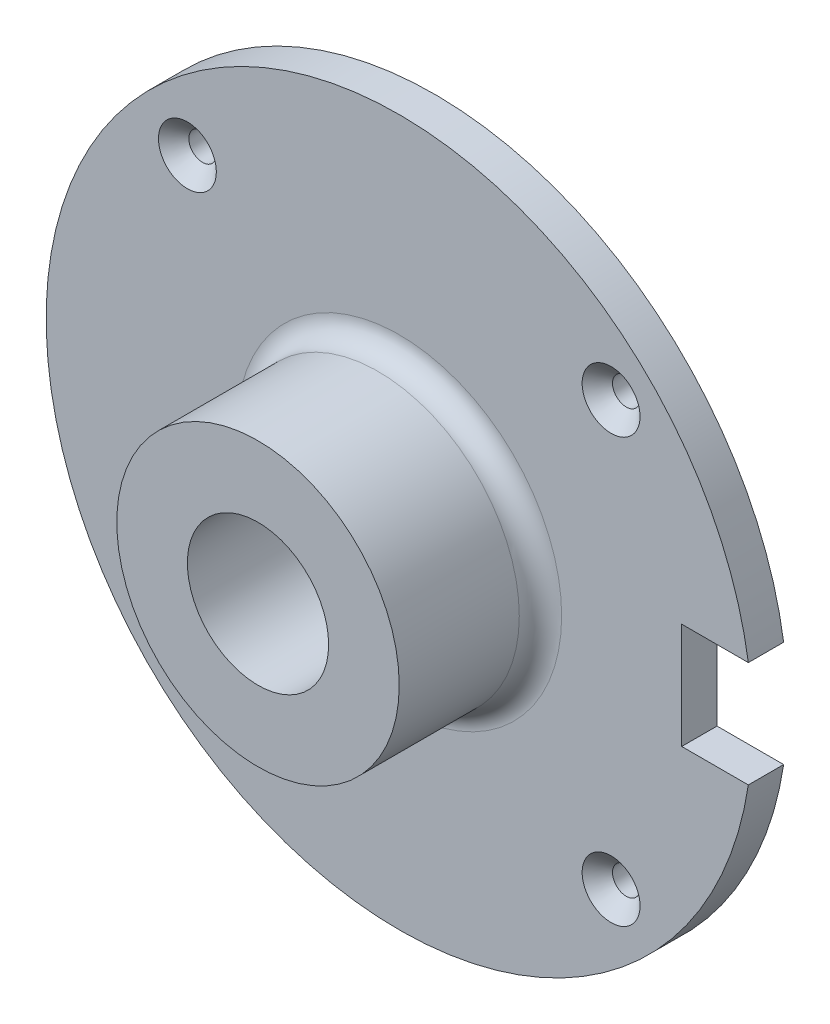
ISO-10303-21;
HEADER;
FILE_DESCRIPTION(('STEP AP214'),'2;1');
FILE_NAME('part.step','',(''),(''),'','','');
FILE_SCHEMA(('AUTOMOTIVE_DESIGN { 1 0 10303 214 1 1 1 1 }'));
ENDSEC;
DATA;
#1=APPLICATION_CONTEXT('core data for automotive mechanical design processes');
#2=APPLICATION_PROTOCOL_DEFINITION('international standard','automotive_design',2000,#1);
#3=PRODUCT_CONTEXT('',#1,'mechanical');
#4=PRODUCT('Part','Part','',(#3));
#5=PRODUCT_RELATED_PRODUCT_CATEGORY('part','',(#4));
#6=PRODUCT_DEFINITION_FORMATION('','',#4);
#7=PRODUCT_DEFINITION_CONTEXT('part definition',#1,'design');
#8=PRODUCT_DEFINITION('design','',#6,#7);
#9=PRODUCT_DEFINITION_SHAPE('','',#8);
#10=(LENGTH_UNIT() NAMED_UNIT(*) SI_UNIT(.MILLI.,.METRE.));
#11=(NAMED_UNIT(*) PLANE_ANGLE_UNIT() SI_UNIT($,.RADIAN.));
#12=(NAMED_UNIT(*) SI_UNIT($,.STERADIAN.) SOLID_ANGLE_UNIT());
#13=UNCERTAINTY_MEASURE_WITH_UNIT(LENGTH_MEASURE(1.E-05),#10,'distance_accuracy_value','');
#14=(GEOMETRIC_REPRESENTATION_CONTEXT(3) GLOBAL_UNCERTAINTY_ASSIGNED_CONTEXT((#13)) GLOBAL_UNIT_ASSIGNED_CONTEXT((#10,
#11,#12)) REPRESENTATION_CONTEXT('',''));
#15=CARTESIAN_POINT('',(0.,0.,0.));
#16=DIRECTION('',(0.,0.,1.));
#17=DIRECTION('',(1.,0.,0.));
#18=AXIS2_PLACEMENT_3D('',#15,#16,#17);
#19=CARTESIAN_POINT('',(0.,0.,50.));
#20=DIRECTION('',(0.,0.,1.));
#21=DIRECTION('',(1.,0.,0.));
#22=AXIS2_PLACEMENT_3D('',#19,#20,#21);
#23=CYLINDRICAL_SURFACE('',#22,50.);
#24=CARTESIAN_POINT('',(0.,0.,5.));
#25=DIRECTION('',(0.,0.,1.));
#26=DIRECTION('',(1.,0.,0.));
#27=AXIS2_PLACEMENT_3D('',#24,#25,#26);
#28=CIRCLE('',#27,50.);
#29=CARTESIAN_POINT('',(49.434299833213,7.5,5.));
#30=VERTEX_POINT('',#29);
#31=CARTESIAN_POINT('',(49.434299833213,-7.5,5.));
#32=VERTEX_POINT('',#31);
#33=EDGE_CURVE('E127',#30,#32,#28,.T.);
#34=ORIENTED_EDGE('',*,*,#33,.F.);
#35=DIRECTION('',(0.,0.,1.));
#36=VECTOR('',#35,1.);
#37=CARTESIAN_POINT('',(49.434299833213,7.5,50.));
#38=LINE('',#37,#36);
#39=CARTESIAN_POINT('',(49.434299833213,7.5,0.));
#40=VERTEX_POINT('',#39);
#41=EDGE_CURVE('E110',#30,#40,#38,.F.);
#42=ORIENTED_EDGE('',*,*,#41,.T.);
#43=CARTESIAN_POINT('',(0.,0.,0.));
#44=DIRECTION('',(0.,0.,1.));
#45=DIRECTION('',(1.,0.,0.));
#46=AXIS2_PLACEMENT_3D('',#43,#44,#45);
#47=CIRCLE('',#46,50.);
#48=CARTESIAN_POINT('',(49.434299833213,-7.5,0.));
#49=VERTEX_POINT('',#48);
#50=EDGE_CURVE('E48',#40,#49,#47,.T.);
#51=ORIENTED_EDGE('',*,*,#50,.T.);
#52=DIRECTION('',(0.,0.,1.));
#53=VECTOR('',#52,1.);
#54=CARTESIAN_POINT('',(49.434299833213,-7.5,50.));
#55=LINE('',#54,#53);
#56=EDGE_CURVE('E93',#49,#32,#55,.T.);
#57=ORIENTED_EDGE('',*,*,#56,.T.);
#58=EDGE_LOOP('',(#34,#42,#51,#57));
#59=FACE_BOUND('',#58,.T.);
#60=ADVANCED_FACE('F40',(#59),#23,.T.);
#61=CARTESIAN_POINT('',(0.,50.,0.));
#62=DIRECTION('',(0.,0.,1.));
#63=DIRECTION('',(1.,0.,0.));
#64=AXIS2_PLACEMENT_3D('',#61,#62,#63);
#65=PLANE('',#64);
#66=CARTESIAN_POINT('',(29.9999999999997,30.0000000000003,0.));
#67=DIRECTION('',(0.,0.,1.));
#68=DIRECTION('',(1.,0.,0.));
#69=AXIS2_PLACEMENT_3D('',#66,#67,#68);
#70=CIRCLE('',#69,1.95);
#71=CARTESIAN_POINT('',(31.9499999999997,30.0000000000003,0.));
#72=VERTEX_POINT('',#71);
#73=EDGE_CURVE('E347',#72,#72,#70,.T.);
#74=ORIENTED_EDGE('',*,*,#73,.T.);
#75=EDGE_LOOP('',(#74));
#76=FACE_BOUND('',#75,.T.);
#77=CARTESIAN_POINT('',(30.0000000000002,-29.9999999999998,0.));
#78=DIRECTION('',(0.,0.,1.));
#79=DIRECTION('',(1.,0.,0.));
#80=AXIS2_PLACEMENT_3D('',#77,#78,#79);
#81=CIRCLE('',#80,1.95);
#82=CARTESIAN_POINT('',(31.9500000000002,-29.9999999999998,0.));
#83=VERTEX_POINT('',#82);
#84=EDGE_CURVE('E358',#83,#83,#81,.T.);
#85=ORIENTED_EDGE('',*,*,#84,.T.);
#86=EDGE_LOOP('',(#85));
#87=FACE_BOUND('',#86,.T.);
#88=CARTESIAN_POINT('',(-29.9999999999999,-30.0000000000001,0.));
#89=DIRECTION('',(0.,0.,1.));
#90=DIRECTION('',(1.,0.,0.));
#91=AXIS2_PLACEMENT_3D('',#88,#89,#90);
#92=CIRCLE('',#91,1.95);
#93=CARTESIAN_POINT('',(-28.0499999999999,-30.0000000000001,0.));
#94=VERTEX_POINT('',#93);
#95=EDGE_CURVE('E367',#94,#94,#92,.T.);
#96=ORIENTED_EDGE('',*,*,#95,.T.);
#97=EDGE_LOOP('',(#96));
#98=FACE_BOUND('',#97,.T.);
#99=CARTESIAN_POINT('',(-30.,30.,0.));
#100=DIRECTION('',(0.,0.,1.));
#101=DIRECTION('',(1.,0.,0.));
#102=AXIS2_PLACEMENT_3D('',#99,#100,#101);
#103=CIRCLE('',#102,1.95);
#104=CARTESIAN_POINT('',(-28.05,30.,0.));
#105=VERTEX_POINT('',#104);
#106=EDGE_CURVE('E103',#105,#105,#103,.T.);
#107=ORIENTED_EDGE('',*,*,#106,.T.);
#108=EDGE_LOOP('',(#107));
#109=FACE_BOUND('',#108,.T.);
#110=ORIENTED_EDGE('',*,*,#50,.F.);
#111=DIRECTION('',(-1.,0.,0.));
#112=VECTOR('',#111,1.);
#113=CARTESIAN_POINT('',(40.,7.5,0.));
#114=LINE('',#113,#112);
#115=CARTESIAN_POINT('',(40.,7.5,0.));
#116=VERTEX_POINT('',#115);
#117=EDGE_CURVE('E63',#40,#116,#114,.T.);
#118=ORIENTED_EDGE('',*,*,#117,.T.);
#119=DIRECTION('',(0.,-1.,0.));
#120=VECTOR('',#119,1.);
#121=CARTESIAN_POINT('',(40.,-7.5,0.));
#122=LINE('',#121,#120);
#123=CARTESIAN_POINT('',(40.,-7.5,0.));
#124=VERTEX_POINT('',#123);
#125=EDGE_CURVE('E84',#116,#124,#122,.T.);
#126=ORIENTED_EDGE('',*,*,#125,.T.);
#127=DIRECTION('',(1.,0.,0.));
#128=VECTOR('',#127,1.);
#129=CARTESIAN_POINT('',(40.,-7.5,0.));
#130=LINE('',#129,#128);
#131=EDGE_CURVE('E90',#124,#49,#130,.T.);
#132=ORIENTED_EDGE('',*,*,#131,.T.);
#133=EDGE_LOOP('',(#110,#118,#126,#132));
#134=FACE_BOUND('',#133,.T.);
#135=CARTESIAN_POINT('',(0.,0.,0.));
#136=DIRECTION('',(0.,0.,1.));
#137=DIRECTION('',(1.,0.,0.));
#138=AXIS2_PLACEMENT_3D('',#135,#136,#137);
#139=CIRCLE('',#138,10.);
#140=CARTESIAN_POINT('',(10.,0.,0.));
#141=VERTEX_POINT('',#140);
#142=EDGE_CURVE('E112',#141,#141,#139,.T.);
#143=ORIENTED_EDGE('',*,*,#142,.T.);
#144=EDGE_LOOP('',(#143));
#145=FACE_BOUND('',#144,.T.);
#146=ADVANCED_FACE('F42',(#76,#87,#98,#109,#134,#145),#65,.F.);
#147=CARTESIAN_POINT('',(0.,23.,5.));
#148=DIRECTION('',(0.,0.,-1.));
#149=DIRECTION('',(-1.,0.,0.));
#150=AXIS2_PLACEMENT_3D('',#147,#148,#149);
#151=PLANE('',#150);
#152=CARTESIAN_POINT('',(29.9999999999997,30.0000000000003,5.));
#153=DIRECTION('',(0.,0.,1.));
#154=DIRECTION('',(1.,0.,0.));
#155=AXIS2_PLACEMENT_3D('',#152,#153,#154);
#156=CIRCLE('',#155,4.1);
#157=CARTESIAN_POINT('',(34.0999999999997,30.0000000000003,5.));
#158=VERTEX_POINT('',#157);
#159=EDGE_CURVE('E345',#158,#158,#156,.T.);
#160=ORIENTED_EDGE('',*,*,#159,.F.);
#161=EDGE_LOOP('',(#160));
#162=FACE_BOUND('',#161,.T.);
#163=CARTESIAN_POINT('',(30.0000000000002,-29.9999999999998,5.));
#164=DIRECTION('',(0.,0.,1.));
#165=DIRECTION('',(1.,0.,0.));
#166=AXIS2_PLACEMENT_3D('',#163,#164,#165);
#167=CIRCLE('',#166,4.1);
#168=CARTESIAN_POINT('',(34.1000000000002,-29.9999999999998,5.));
#169=VERTEX_POINT('',#168);
#170=EDGE_CURVE('E352',#169,#169,#167,.T.);
#171=ORIENTED_EDGE('',*,*,#170,.F.);
#172=EDGE_LOOP('',(#171));
#173=FACE_BOUND('',#172,.T.);
#174=CARTESIAN_POINT('',(-29.9999999999999,-30.0000000000001,5.));
#175=DIRECTION('',(0.,0.,1.));
#176=DIRECTION('',(1.,0.,0.));
#177=AXIS2_PLACEMENT_3D('',#174,#175,#176);
#178=CIRCLE('',#177,4.1);
#179=CARTESIAN_POINT('',(-25.8999999999999,-30.0000000000001,5.));
#180=VERTEX_POINT('',#179);
#181=EDGE_CURVE('E361',#180,#180,#178,.T.);
#182=ORIENTED_EDGE('',*,*,#181,.F.);
#183=EDGE_LOOP('',(#182));
#184=FACE_BOUND('',#183,.T.);
#185=CARTESIAN_POINT('',(-30.,30.,5.));
#186=DIRECTION('',(0.,0.,1.));
#187=DIRECTION('',(1.,0.,0.));
#188=AXIS2_PLACEMENT_3D('',#185,#186,#187);
#189=CIRCLE('',#188,4.1);
#190=CARTESIAN_POINT('',(-25.9,30.,5.));
#191=VERTEX_POINT('',#190);
#192=EDGE_CURVE('E370',#191,#191,#189,.T.);
#193=ORIENTED_EDGE('',*,*,#192,.F.);
#194=EDGE_LOOP('',(#193));
#195=FACE_BOUND('',#194,.T.);
#196=CARTESIAN_POINT('',(0.,0.,5.));
#197=DIRECTION('',(0.,0.,1.));
#198=DIRECTION('',(1.,0.,0.));
#199=AXIS2_PLACEMENT_3D('',#196,#197,#198);
#200=CIRCLE('',#199,23.);
#201=CARTESIAN_POINT('',(23.,0.,5.));
#202=VERTEX_POINT('',#201);
#203=EDGE_CURVE('E124',#202,#202,#200,.T.);
#204=ORIENTED_EDGE('',*,*,#203,.F.);
#205=EDGE_LOOP('',(#204));
#206=FACE_BOUND('',#205,.T.);
#207=DIRECTION('',(0.,-1.,0.));
#208=VECTOR('',#207,1.);
#209=CARTESIAN_POINT('',(40.,-7.5,5.));
#210=LINE('',#209,#208);
#211=CARTESIAN_POINT('',(40.,7.5,5.));
#212=VERTEX_POINT('',#211);
#213=CARTESIAN_POINT('',(40.,-7.5,5.));
#214=VERTEX_POINT('',#213);
#215=EDGE_CURVE('E55',#212,#214,#210,.T.);
#216=ORIENTED_EDGE('',*,*,#215,.F.);
#217=DIRECTION('',(1.,0.,0.));
#218=VECTOR('',#217,1.);
#219=CARTESIAN_POINT('',(0.,7.5,5.));
#220=LINE('',#219,#218);
#221=EDGE_CURVE('E11',#212,#30,#220,.T.);
#222=ORIENTED_EDGE('',*,*,#221,.T.);
#223=ORIENTED_EDGE('',*,*,#33,.T.);
#224=DIRECTION('',(1.,0.,0.));
#225=VECTOR('',#224,1.);
#226=CARTESIAN_POINT('',(40.,-7.5,5.));
#227=LINE('',#226,#225);
#228=EDGE_CURVE('E99',#214,#32,#227,.T.);
#229=ORIENTED_EDGE('',*,*,#228,.F.);
#230=EDGE_LOOP('',(#216,#222,#223,#229));
#231=FACE_BOUND('',#230,.T.);
#232=ADVANCED_FACE('F133',(#162,#173,#184,#195,#206,#231),#151,.F.);
#233=CARTESIAN_POINT('',(0.,0.,8.));
#234=DIRECTION('',(0.,0.,1.));
#235=DIRECTION('',(1.,0.,0.));
#236=AXIS2_PLACEMENT_3D('',#233,#234,#235);
#237=TOROIDAL_SURFACE('',#236,23.,3.);
#238=CARTESIAN_POINT('',(0.,0.,8.00000000000002));
#239=DIRECTION('',(0.,0.,1.));
#240=DIRECTION('',(1.,0.,0.));
#241=AXIS2_PLACEMENT_3D('',#238,#239,#240);
#242=CIRCLE('',#241,20.);
#243=CARTESIAN_POINT('',(20.,0.,8.00000000000002));
#244=VERTEX_POINT('',#243);
#245=EDGE_CURVE('E121',#244,#244,#242,.T.);
#246=ORIENTED_EDGE('',*,*,#245,.F.);
#247=EDGE_LOOP('',(#246));
#248=FACE_BOUND('',#247,.T.);
#249=ORIENTED_EDGE('',*,*,#203,.T.);
#250=EDGE_LOOP('',(#249));
#251=FACE_BOUND('',#250,.T.);
#252=ADVANCED_FACE('F135',(#248,#251),#237,.F.);
#253=CARTESIAN_POINT('',(0.,0.,50.));
#254=DIRECTION('',(0.,0.,1.));
#255=DIRECTION('',(1.,0.,0.));
#256=AXIS2_PLACEMENT_3D('',#253,#254,#255);
#257=CYLINDRICAL_SURFACE('',#256,20.);
#258=CARTESIAN_POINT('',(0.,0.,25.));
#259=DIRECTION('',(0.,0.,1.));
#260=DIRECTION('',(1.,0.,0.));
#261=AXIS2_PLACEMENT_3D('',#258,#259,#260);
#262=CIRCLE('',#261,20.);
#263=CARTESIAN_POINT('',(20.,0.,25.));
#264=VERTEX_POINT('',#263);
#265=EDGE_CURVE('E118',#264,#264,#262,.T.);
#266=ORIENTED_EDGE('',*,*,#265,.F.);
#267=EDGE_LOOP('',(#266));
#268=FACE_BOUND('',#267,.T.);
#269=ORIENTED_EDGE('',*,*,#245,.T.);
#270=EDGE_LOOP('',(#269));
#271=FACE_BOUND('',#270,.T.);
#272=ADVANCED_FACE('F142',(#268,#271),#257,.T.);
#273=CARTESIAN_POINT('',(0.,10.,25.));
#274=DIRECTION('',(0.,0.,-1.));
#275=DIRECTION('',(-1.,0.,0.));
#276=AXIS2_PLACEMENT_3D('',#273,#274,#275);
#277=PLANE('',#276);
#278=CARTESIAN_POINT('',(0.,0.,25.));
#279=DIRECTION('',(0.,0.,1.));
#280=DIRECTION('',(1.,0.,0.));
#281=AXIS2_PLACEMENT_3D('',#278,#279,#280);
#282=CIRCLE('',#281,10.);
#283=CARTESIAN_POINT('',(10.,0.,25.));
#284=VERTEX_POINT('',#283);
#285=EDGE_CURVE('E115',#284,#284,#282,.T.);
#286=ORIENTED_EDGE('',*,*,#285,.F.);
#287=EDGE_LOOP('',(#286));
#288=FACE_BOUND('',#287,.T.);
#289=ORIENTED_EDGE('',*,*,#265,.T.);
#290=EDGE_LOOP('',(#289));
#291=FACE_BOUND('',#290,.T.);
#292=ADVANCED_FACE('F176',(#288,#291),#277,.F.);
#293=CARTESIAN_POINT('',(0.,0.,50.));
#294=DIRECTION('',(0.,0.,1.));
#295=DIRECTION('',(1.,0.,0.));
#296=AXIS2_PLACEMENT_3D('',#293,#294,#295);
#297=CYLINDRICAL_SURFACE('',#296,10.);
#298=ORIENTED_EDGE('',*,*,#142,.F.);
#299=EDGE_LOOP('',(#298));
#300=FACE_BOUND('',#299,.T.);
#301=ORIENTED_EDGE('',*,*,#285,.T.);
#302=EDGE_LOOP('',(#301));
#303=FACE_BOUND('',#302,.T.);
#304=ADVANCED_FACE('F186',(#300,#303),#297,.F.);
#305=CARTESIAN_POINT('',(40.,7.5,0.));
#306=DIRECTION('',(0.,1.,0.));
#307=DIRECTION('',(0.,0.,1.));
#308=AXIS2_PLACEMENT_3D('',#305,#306,#307);
#309=PLANE('',#308);
#310=ORIENTED_EDGE('',*,*,#221,.F.);
#311=DIRECTION('',(0.,0.,1.));
#312=VECTOR('',#311,1.);
#313=CARTESIAN_POINT('',(40.,7.5,0.));
#314=LINE('',#313,#312);
#315=EDGE_CURVE('E87',#116,#212,#314,.T.);
#316=ORIENTED_EDGE('',*,*,#315,.F.);
#317=ORIENTED_EDGE('',*,*,#117,.F.);
#318=ORIENTED_EDGE('',*,*,#41,.F.);
#319=EDGE_LOOP('',(#310,#316,#317,#318));
#320=FACE_BOUND('',#319,.T.);
#321=ADVANCED_FACE('F131',(#320),#309,.F.);
#322=CARTESIAN_POINT('',(40.,-7.5,0.));
#323=DIRECTION('',(0.,-1.,0.));
#324=DIRECTION('',(0.,0.,-1.));
#325=AXIS2_PLACEMENT_3D('',#322,#323,#324);
#326=PLANE('',#325);
#327=ORIENTED_EDGE('',*,*,#131,.F.);
#328=DIRECTION('',(0.,0.,1.));
#329=VECTOR('',#328,1.);
#330=CARTESIAN_POINT('',(40.,-7.5,0.));
#331=LINE('',#330,#329);
#332=EDGE_CURVE('E80',#124,#214,#331,.T.);
#333=ORIENTED_EDGE('',*,*,#332,.T.);
#334=ORIENTED_EDGE('',*,*,#228,.T.);
#335=ORIENTED_EDGE('',*,*,#56,.F.);
#336=EDGE_LOOP('',(#327,#333,#334,#335));
#337=FACE_BOUND('',#336,.T.);
#338=ADVANCED_FACE('F91',(#337),#326,.F.);
#339=CARTESIAN_POINT('',(40.,-7.5,0.));
#340=DIRECTION('',(-1.,0.,0.));
#341=DIRECTION('',(0.,0.,1.));
#342=AXIS2_PLACEMENT_3D('',#339,#340,#341);
#343=PLANE('',#342);
#344=ORIENTED_EDGE('',*,*,#215,.T.);
#345=ORIENTED_EDGE('',*,*,#332,.F.);
#346=ORIENTED_EDGE('',*,*,#125,.F.);
#347=ORIENTED_EDGE('',*,*,#315,.T.);
#348=EDGE_LOOP('',(#344,#345,#346,#347));
#349=FACE_BOUND('',#348,.T.);
#350=ADVANCED_FACE('F82',(#349),#343,.F.);
#351=CARTESIAN_POINT('',(-30.,30.,5.));
#352=DIRECTION('',(0.,0.,1.));
#353=DIRECTION('',(1.,0.,0.));
#354=AXIS2_PLACEMENT_3D('',#351,#352,#353);
#355=CYLINDRICAL_SURFACE('',#354,1.95);
#356=ORIENTED_EDGE('',*,*,#106,.F.);
#357=EDGE_LOOP('',(#356));
#358=FACE_BOUND('',#357,.T.);
#359=CARTESIAN_POINT('',(-30.,30.,2.85));
#360=DIRECTION('',(0.,0.,1.));
#361=DIRECTION('',(1.,0.,0.));
#362=AXIS2_PLACEMENT_3D('',#359,#360,#361);
#363=CIRCLE('',#362,1.95);
#364=CARTESIAN_POINT('',(-28.05,30.,2.85));
#365=VERTEX_POINT('',#364);
#366=EDGE_CURVE('E372',#365,#365,#363,.T.);
#367=ORIENTED_EDGE('',*,*,#366,.T.);
#368=EDGE_LOOP('',(#367));
#369=FACE_BOUND('',#368,.T.);
#370=ADVANCED_FACE('F221',(#358,#369),#355,.F.);
#371=CARTESIAN_POINT('',(-30.,30.,5.));
#372=DIRECTION('',(0.,0.,1.));
#373=DIRECTION('',(1.,0.,0.));
#374=AXIS2_PLACEMENT_3D('',#371,#372,#373);
#375=CONICAL_SURFACE('',#374,4.1,0.785398163397448);
#376=ORIENTED_EDGE('',*,*,#366,.F.);
#377=EDGE_LOOP('',(#376));
#378=FACE_BOUND('',#377,.T.);
#379=ORIENTED_EDGE('',*,*,#192,.T.);
#380=EDGE_LOOP('',(#379));
#381=FACE_BOUND('',#380,.T.);
#382=ADVANCED_FACE('F230',(#378,#381),#375,.F.);
#383=CARTESIAN_POINT('',(-29.9999999999999,-30.0000000000001,5.));
#384=DIRECTION('',(0.,0.,1.));
#385=DIRECTION('',(1.,0.,0.));
#386=AXIS2_PLACEMENT_3D('',#383,#384,#385);
#387=CYLINDRICAL_SURFACE('',#386,1.95);
#388=ORIENTED_EDGE('',*,*,#95,.F.);
#389=EDGE_LOOP('',(#388));
#390=FACE_BOUND('',#389,.T.);
#391=CARTESIAN_POINT('',(-29.9999999999999,-30.0000000000001,2.85));
#392=DIRECTION('',(0.,0.,1.));
#393=DIRECTION('',(1.,0.,0.));
#394=AXIS2_PLACEMENT_3D('',#391,#392,#393);
#395=CIRCLE('',#394,1.95);
#396=CARTESIAN_POINT('',(-28.0499999999999,-30.0000000000001,2.85));
#397=VERTEX_POINT('',#396);
#398=EDGE_CURVE('E364',#397,#397,#395,.T.);
#399=ORIENTED_EDGE('',*,*,#398,.T.);
#400=EDGE_LOOP('',(#399));
#401=FACE_BOUND('',#400,.T.);
#402=ADVANCED_FACE('F239',(#390,#401),#387,.F.);
#403=CARTESIAN_POINT('',(-29.9999999999999,-30.0000000000001,5.));
#404=DIRECTION('',(0.,0.,1.));
#405=DIRECTION('',(1.,0.,0.));
#406=AXIS2_PLACEMENT_3D('',#403,#404,#405);
#407=CONICAL_SURFACE('',#406,4.1,0.785398163397448);
#408=ORIENTED_EDGE('',*,*,#398,.F.);
#409=EDGE_LOOP('',(#408));
#410=FACE_BOUND('',#409,.T.);
#411=ORIENTED_EDGE('',*,*,#181,.T.);
#412=EDGE_LOOP('',(#411));
#413=FACE_BOUND('',#412,.T.);
#414=ADVANCED_FACE('F248',(#410,#413),#407,.F.);
#415=CARTESIAN_POINT('',(30.0000000000002,-29.9999999999998,5.));
#416=DIRECTION('',(0.,0.,1.));
#417=DIRECTION('',(1.,0.,0.));
#418=AXIS2_PLACEMENT_3D('',#415,#416,#417);
#419=CYLINDRICAL_SURFACE('',#418,1.95);
#420=ORIENTED_EDGE('',*,*,#84,.F.);
#421=EDGE_LOOP('',(#420));
#422=FACE_BOUND('',#421,.T.);
#423=CARTESIAN_POINT('',(30.0000000000002,-29.9999999999998,2.85));
#424=DIRECTION('',(0.,0.,1.));
#425=DIRECTION('',(1.,0.,0.));
#426=AXIS2_PLACEMENT_3D('',#423,#424,#425);
#427=CIRCLE('',#426,1.95);
#428=CARTESIAN_POINT('',(31.9500000000002,-29.9999999999998,2.85));
#429=VERTEX_POINT('',#428);
#430=EDGE_CURVE('E355',#429,#429,#427,.T.);
#431=ORIENTED_EDGE('',*,*,#430,.T.);
#432=EDGE_LOOP('',(#431));
#433=FACE_BOUND('',#432,.T.);
#434=ADVANCED_FACE('F258',(#422,#433),#419,.F.);
#435=CARTESIAN_POINT('',(30.0000000000002,-29.9999999999998,5.));
#436=DIRECTION('',(0.,0.,1.));
#437=DIRECTION('',(1.,0.,0.));
#438=AXIS2_PLACEMENT_3D('',#435,#436,#437);
#439=CONICAL_SURFACE('',#438,4.1,0.78539816339745);
#440=ORIENTED_EDGE('',*,*,#430,.F.);
#441=EDGE_LOOP('',(#440));
#442=FACE_BOUND('',#441,.T.);
#443=ORIENTED_EDGE('',*,*,#170,.T.);
#444=EDGE_LOOP('',(#443));
#445=FACE_BOUND('',#444,.T.);
#446=ADVANCED_FACE('F268',(#442,#445),#439,.F.);
#447=CARTESIAN_POINT('',(29.9999999999997,30.0000000000003,5.));
#448=DIRECTION('',(0.,0.,1.));
#449=DIRECTION('',(1.,0.,0.));
#450=AXIS2_PLACEMENT_3D('',#447,#448,#449);
#451=CYLINDRICAL_SURFACE('',#450,1.95);
#452=ORIENTED_EDGE('',*,*,#73,.F.);
#453=EDGE_LOOP('',(#452));
#454=FACE_BOUND('',#453,.T.);
#455=CARTESIAN_POINT('',(29.9999999999997,30.0000000000003,2.85));
#456=DIRECTION('',(0.,0.,1.));
#457=DIRECTION('',(1.,0.,0.));
#458=AXIS2_PLACEMENT_3D('',#455,#456,#457);
#459=CIRCLE('',#458,1.95);
#460=CARTESIAN_POINT('',(31.9499999999997,30.0000000000003,2.85));
#461=VERTEX_POINT('',#460);
#462=EDGE_CURVE('E343',#461,#461,#459,.T.);
#463=ORIENTED_EDGE('',*,*,#462,.T.);
#464=EDGE_LOOP('',(#463));
#465=FACE_BOUND('',#464,.T.);
#466=ADVANCED_FACE('F278',(#454,#465),#451,.F.);
#467=CARTESIAN_POINT('',(29.9999999999997,30.0000000000003,5.));
#468=DIRECTION('',(0.,0.,1.));
#469=DIRECTION('',(1.,0.,0.));
#470=AXIS2_PLACEMENT_3D('',#467,#468,#469);
#471=CONICAL_SURFACE('',#470,4.1,0.78539816339745);
#472=ORIENTED_EDGE('',*,*,#462,.F.);
#473=EDGE_LOOP('',(#472));
#474=FACE_BOUND('',#473,.T.);
#475=ORIENTED_EDGE('',*,*,#159,.T.);
#476=EDGE_LOOP('',(#475));
#477=FACE_BOUND('',#476,.T.);
#478=ADVANCED_FACE('F288',(#474,#477),#471,.F.);
#479=CLOSED_SHELL('',(#60,#146,#232,#252,#272,#292,#304,#321,#338,#350,#370,#382,#402,#414,#434,
#446,#466,#478));
#480=MANIFOLD_SOLID_BREP('B2',#479);
#481=ADVANCED_BREP_SHAPE_REPRESENTATION('',(#18,#480),#14);
#482=SHAPE_DEFINITION_REPRESENTATION(#9,#481);
ENDSEC;
END-ISO-10303-21;
